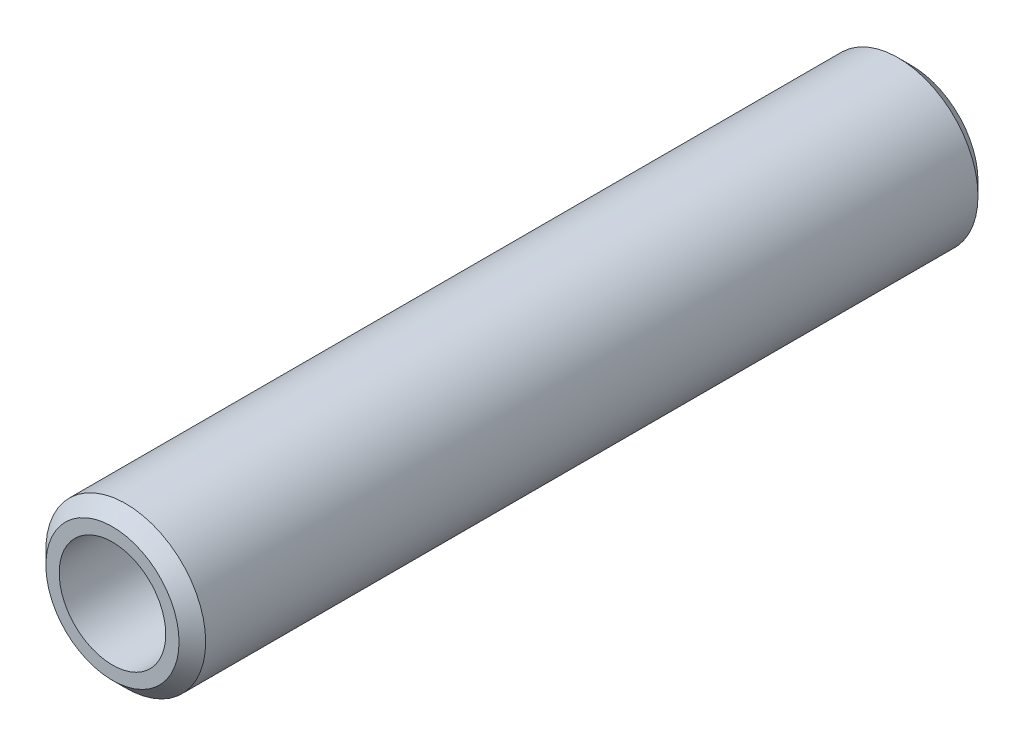
ISO-10303-21;
HEADER;
FILE_DESCRIPTION(('STEP AP214'),'2;1');
FILE_NAME('part.step','',(''),(''),'','','');
FILE_SCHEMA(('AUTOMOTIVE_DESIGN { 1 0 10303 214 1 1 1 1 }'));
ENDSEC;
DATA;
#1=APPLICATION_CONTEXT('core data for automotive mechanical design processes');
#2=APPLICATION_PROTOCOL_DEFINITION('international standard','automotive_design',2000,#1);
#3=PRODUCT_CONTEXT('',#1,'mechanical');
#4=PRODUCT('Part','Part','',(#3));
#5=PRODUCT_RELATED_PRODUCT_CATEGORY('part','',(#4));
#6=PRODUCT_DEFINITION_FORMATION('','',#4);
#7=PRODUCT_DEFINITION_CONTEXT('part definition',#1,'design');
#8=PRODUCT_DEFINITION('design','',#6,#7);
#9=PRODUCT_DEFINITION_SHAPE('','',#8);
#10=(LENGTH_UNIT() NAMED_UNIT(*) SI_UNIT(.MILLI.,.METRE.));
#11=(NAMED_UNIT(*) PLANE_ANGLE_UNIT() SI_UNIT($,.RADIAN.));
#12=(NAMED_UNIT(*) SI_UNIT($,.STERADIAN.) SOLID_ANGLE_UNIT());
#13=UNCERTAINTY_MEASURE_WITH_UNIT(LENGTH_MEASURE(1.E-05),#10,'distance_accuracy_value','');
#14=(GEOMETRIC_REPRESENTATION_CONTEXT(3) GLOBAL_UNCERTAINTY_ASSIGNED_CONTEXT((#13)) GLOBAL_UNIT_ASSIGNED_CONTEXT((#10,
#11,#12)) REPRESENTATION_CONTEXT('',''));
#15=CARTESIAN_POINT('',(0.,0.,0.));
#16=DIRECTION('',(0.,0.,1.));
#17=DIRECTION('',(1.,0.,0.));
#18=AXIS2_PLACEMENT_3D('',#15,#16,#17);
#19=CARTESIAN_POINT('',(-22.8344490662139,8.61400679117148,30.));
#20=DIRECTION('',(0.,0.,1.));
#21=DIRECTION('',(1.,0.,0.));
#22=AXIS2_PLACEMENT_3D('',#19,#20,#21);
#23=PLANE('',#22);
#24=CARTESIAN_POINT('',(-22.8344490662139,8.61400679117148,30.));
#25=DIRECTION('',(0.,0.,1.));
#26=DIRECTION('',(1.,0.,0.));
#27=AXIS2_PLACEMENT_3D('',#24,#25,#26);
#28=CIRCLE('',#27,2.5);
#29=CARTESIAN_POINT('',(-20.3344490662139,8.61400679117148,30.));
#30=VERTEX_POINT('',#29);
#31=EDGE_CURVE('E45',#30,#30,#28,.T.);
#32=ORIENTED_EDGE('',*,*,#31,.T.);
#33=EDGE_LOOP('',(#32));
#34=FACE_BOUND('',#33,.T.);
#35=CARTESIAN_POINT('',(-22.8344490662139,8.61400679117148,30.));
#36=DIRECTION('',(0.,0.,1.));
#37=DIRECTION('',(1.,0.,0.));
#38=AXIS2_PLACEMENT_3D('',#35,#36,#37);
#39=CIRCLE('',#38,2.);
#40=CARTESIAN_POINT('',(-20.8344490662139,8.61400679117148,30.));
#41=VERTEX_POINT('',#40);
#42=EDGE_CURVE('E50',#41,#41,#39,.T.);
#43=ORIENTED_EDGE('',*,*,#42,.F.);
#44=EDGE_LOOP('',(#43));
#45=FACE_BOUND('',#44,.T.);
#46=ADVANCED_FACE('F30',(#34,#45),#23,.T.);
#47=CARTESIAN_POINT('',(-22.8344490662139,8.61400679117148,0.));
#48=DIRECTION('',(0.,0.,1.));
#49=DIRECTION('',(1.,0.,0.));
#50=AXIS2_PLACEMENT_3D('',#47,#48,#49);
#51=PLANE('',#50);
#52=CARTESIAN_POINT('',(-22.8344490662139,8.61400679117148,0.));
#53=DIRECTION('',(0.,0.,1.));
#54=DIRECTION('',(1.,0.,0.));
#55=AXIS2_PLACEMENT_3D('',#52,#53,#54);
#56=CIRCLE('',#55,2.5);
#57=CARTESIAN_POINT('',(-20.3344490662139,8.61400679117148,0.));
#58=VERTEX_POINT('',#57);
#59=EDGE_CURVE('E10',#58,#58,#56,.F.);
#60=ORIENTED_EDGE('',*,*,#59,.T.);
#61=EDGE_LOOP('',(#60));
#62=FACE_BOUND('',#61,.T.);
#63=CARTESIAN_POINT('',(-22.8344490662139,8.61400679117148,0.));
#64=DIRECTION('',(0.,0.,1.));
#65=DIRECTION('',(1.,0.,0.));
#66=AXIS2_PLACEMENT_3D('',#63,#64,#65);
#67=CIRCLE('',#66,2.);
#68=CARTESIAN_POINT('',(-20.8344490662139,8.61400679117148,0.));
#69=VERTEX_POINT('',#68);
#70=EDGE_CURVE('E51',#69,#69,#67,.T.);
#71=ORIENTED_EDGE('',*,*,#70,.T.);
#72=EDGE_LOOP('',(#71));
#73=FACE_BOUND('',#72,.T.);
#74=ADVANCED_FACE('F61',(#62,#73),#51,.F.);
#75=CARTESIAN_POINT('',(-22.8344490662139,8.61400679117148,30.));
#76=DIRECTION('',(0.,0.,-1.));
#77=DIRECTION('',(-1.,0.,0.));
#78=AXIS2_PLACEMENT_3D('',#75,#76,#77);
#79=CYLINDRICAL_SURFACE('',#78,3.);
#80=CARTESIAN_POINT('',(-22.8344490662139,8.61400679117148,29.5));
#81=DIRECTION('',(0.,0.,1.));
#82=DIRECTION('',(1.,0.,0.));
#83=AXIS2_PLACEMENT_3D('',#80,#81,#82);
#84=CIRCLE('',#83,3.);
#85=CARTESIAN_POINT('',(-19.8344490662139,8.61400679117148,29.5));
#86=VERTEX_POINT('',#85);
#87=EDGE_CURVE('E37',#86,#86,#84,.F.);
#88=ORIENTED_EDGE('',*,*,#87,.T.);
#89=EDGE_LOOP('',(#88));
#90=FACE_BOUND('',#89,.T.);
#91=CARTESIAN_POINT('',(-22.8344490662139,8.61400679117148,0.500000000000007));
#92=DIRECTION('',(0.,0.,1.));
#93=DIRECTION('',(1.,0.,0.));
#94=AXIS2_PLACEMENT_3D('',#91,#92,#93);
#95=CIRCLE('',#94,3.);
#96=CARTESIAN_POINT('',(-19.8344490662139,8.61400679117148,0.500000000000007));
#97=VERTEX_POINT('',#96);
#98=EDGE_CURVE('E41',#97,#97,#95,.T.);
#99=ORIENTED_EDGE('',*,*,#98,.T.);
#100=EDGE_LOOP('',(#99));
#101=FACE_BOUND('',#100,.T.);
#102=ADVANCED_FACE('F67',(#90,#101),#79,.T.);
#103=CARTESIAN_POINT('',(-22.8344490662139,8.61400679117148,30.));
#104=DIRECTION('',(0.,0.,-1.));
#105=DIRECTION('',(-1.,0.,0.));
#106=AXIS2_PLACEMENT_3D('',#103,#104,#105);
#107=CYLINDRICAL_SURFACE('',#106,2.);
#108=ORIENTED_EDGE('',*,*,#42,.T.);
#109=EDGE_LOOP('',(#108));
#110=FACE_BOUND('',#109,.T.);
#111=ORIENTED_EDGE('',*,*,#70,.F.);
#112=EDGE_LOOP('',(#111));
#113=FACE_BOUND('',#112,.T.);
#114=ADVANCED_FACE('F57',(#110,#113),#107,.F.);
#115=CARTESIAN_POINT('',(-22.8344490662139,8.61400679117148,30.));
#116=DIRECTION('',(0.,0.,-1.));
#117=DIRECTION('',(-1.,0.,0.));
#118=AXIS2_PLACEMENT_3D('',#115,#116,#117);
#119=CONICAL_SURFACE('',#118,2.5,0.785398163397447);
#120=ORIENTED_EDGE('',*,*,#87,.F.);
#121=EDGE_LOOP('',(#120));
#122=FACE_BOUND('',#121,.T.);
#123=ORIENTED_EDGE('',*,*,#31,.F.);
#124=EDGE_LOOP('',(#123));
#125=FACE_BOUND('',#124,.T.);
#126=ADVANCED_FACE('F72',(#122,#125),#119,.T.);
#127=CARTESIAN_POINT('',(-22.8344490662139,8.61400679117148,0.500000000000007));
#128=DIRECTION('',(0.,0.,1.));
#129=DIRECTION('',(1.,0.,0.));
#130=AXIS2_PLACEMENT_3D('',#127,#128,#129);
#131=CONICAL_SURFACE('',#130,3.,0.785398163397447);
#132=ORIENTED_EDGE('',*,*,#59,.F.);
#133=EDGE_LOOP('',(#132));
#134=FACE_BOUND('',#133,.T.);
#135=ORIENTED_EDGE('',*,*,#98,.F.);
#136=EDGE_LOOP('',(#135));
#137=FACE_BOUND('',#136,.T.);
#138=ADVANCED_FACE('F32',(#134,#137),#131,.T.);
#139=CLOSED_SHELL('',(#46,#74,#102,#114,#126,#138));
#140=MANIFOLD_SOLID_BREP('B2',#139);
#141=ADVANCED_BREP_SHAPE_REPRESENTATION('',(#18,#140),#14);
#142=SHAPE_DEFINITION_REPRESENTATION(#9,#141);
ENDSEC;
END-ISO-10303-21;
